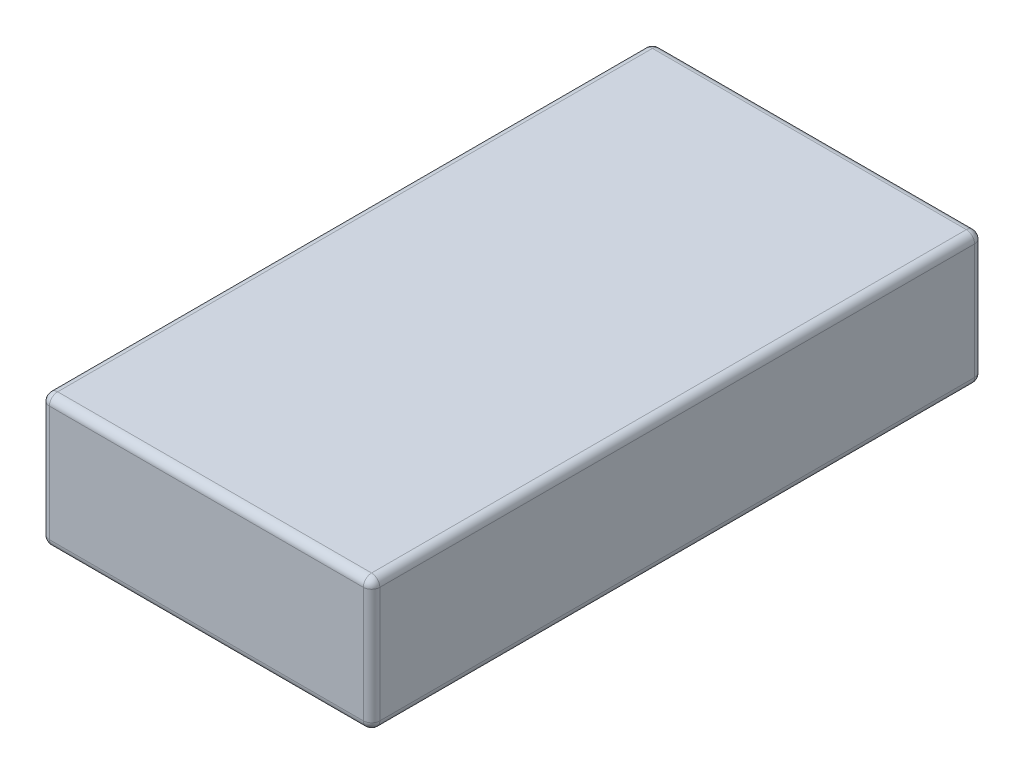
ISO-10303-21;
HEADER;
FILE_DESCRIPTION(('STEP AP214'),'2;1');
FILE_NAME('part.step','',(''),(''),'','','');
FILE_SCHEMA(('AUTOMOTIVE_DESIGN { 1 0 10303 214 1 1 1 1 }'));
ENDSEC;
DATA;
#1=APPLICATION_CONTEXT('core data for automotive mechanical design processes');
#2=APPLICATION_PROTOCOL_DEFINITION('international standard','automotive_design',2000,#1);
#3=PRODUCT_CONTEXT('',#1,'mechanical');
#4=PRODUCT('Part','Part','',(#3));
#5=PRODUCT_RELATED_PRODUCT_CATEGORY('part','',(#4));
#6=PRODUCT_DEFINITION_FORMATION('','',#4);
#7=PRODUCT_DEFINITION_CONTEXT('part definition',#1,'design');
#8=PRODUCT_DEFINITION('design','',#6,#7);
#9=PRODUCT_DEFINITION_SHAPE('','',#8);
#10=(LENGTH_UNIT() NAMED_UNIT(*) SI_UNIT(.MILLI.,.METRE.));
#11=(NAMED_UNIT(*) PLANE_ANGLE_UNIT() SI_UNIT($,.RADIAN.));
#12=(NAMED_UNIT(*) SI_UNIT($,.STERADIAN.) SOLID_ANGLE_UNIT());
#13=UNCERTAINTY_MEASURE_WITH_UNIT(LENGTH_MEASURE(1.E-05),#10,'distance_accuracy_value','');
#14=(GEOMETRIC_REPRESENTATION_CONTEXT(3) GLOBAL_UNCERTAINTY_ASSIGNED_CONTEXT((#13)) GLOBAL_UNIT_ASSIGNED_CONTEXT((#10,
#11,#12)) REPRESENTATION_CONTEXT('',''));
#15=CARTESIAN_POINT('',(0.,0.,0.));
#16=DIRECTION('',(0.,0.,1.));
#17=DIRECTION('',(1.,0.,0.));
#18=AXIS2_PLACEMENT_3D('',#15,#16,#17);
#19=CARTESIAN_POINT('',(10.,8.,18.5));
#20=DIRECTION('',(-1.,0.,0.));
#21=DIRECTION('',(0.,0.,1.));
#22=AXIS2_PLACEMENT_3D('',#19,#20,#21);
#23=PLANE('',#22);
#24=DIRECTION('',(0.,-1.,0.));
#25=VECTOR('',#24,1.);
#26=CARTESIAN_POINT('',(10.,8.,18.));
#27=LINE('',#26,#25);
#28=CARTESIAN_POINT('',(10.,7.5,18.));
#29=VERTEX_POINT('',#28);
#30=CARTESIAN_POINT('',(10.,0.5,18.));
#31=VERTEX_POINT('',#30);
#32=EDGE_CURVE('E208',#29,#31,#27,.T.);
#33=ORIENTED_EDGE('',*,*,#32,.T.);
#34=DIRECTION('',(0.,0.,-1.));
#35=VECTOR('',#34,1.);
#36=CARTESIAN_POINT('',(10.,0.5,-18.5));
#37=LINE('',#36,#35);
#38=CARTESIAN_POINT('',(10.,0.5,-18.));
#39=VERTEX_POINT('',#38);
#40=EDGE_CURVE('E212',#31,#39,#37,.T.);
#41=ORIENTED_EDGE('',*,*,#40,.T.);
#42=DIRECTION('',(0.,-1.,0.));
#43=VECTOR('',#42,1.);
#44=CARTESIAN_POINT('',(10.,8.,-18.));
#45=LINE('',#44,#43);
#46=CARTESIAN_POINT('',(10.,7.5,-18.));
#47=VERTEX_POINT('',#46);
#48=EDGE_CURVE('E205',#39,#47,#45,.F.);
#49=ORIENTED_EDGE('',*,*,#48,.T.);
#50=DIRECTION('',(0.,0.,-1.));
#51=VECTOR('',#50,1.);
#52=CARTESIAN_POINT('',(10.,7.5,18.5));
#53=LINE('',#52,#51);
#54=EDGE_CURVE('E202',#47,#29,#53,.F.);
#55=ORIENTED_EDGE('',*,*,#54,.T.);
#56=EDGE_LOOP('',(#33,#41,#49,#55));
#57=FACE_BOUND('',#56,.T.);
#58=ADVANCED_FACE('F39',(#57),#23,.F.);
#59=CARTESIAN_POINT('',(-10.,8.,-18.5));
#60=DIRECTION('',(0.,0.,1.));
#61=DIRECTION('',(1.,0.,0.));
#62=AXIS2_PLACEMENT_3D('',#59,#60,#61);
#63=PLANE('',#62);
#64=DIRECTION('',(0.,-1.,0.));
#65=VECTOR('',#64,1.);
#66=CARTESIAN_POINT('',(9.5,8.,-18.5));
#67=LINE('',#66,#65);
#68=CARTESIAN_POINT('',(9.5,7.5,-18.5));
#69=VERTEX_POINT('',#68);
#70=CARTESIAN_POINT('',(9.5,0.5,-18.5));
#71=VERTEX_POINT('',#70);
#72=EDGE_CURVE('E181',#69,#71,#67,.T.);
#73=ORIENTED_EDGE('',*,*,#72,.T.);
#74=DIRECTION('',(-1.,0.,0.));
#75=VECTOR('',#74,1.);
#76=CARTESIAN_POINT('',(-10.,0.5,-18.5));
#77=LINE('',#76,#75);
#78=CARTESIAN_POINT('',(-9.5,0.5,-18.5));
#79=VERTEX_POINT('',#78);
#80=EDGE_CURVE('E188',#71,#79,#77,.T.);
#81=ORIENTED_EDGE('',*,*,#80,.T.);
#82=DIRECTION('',(0.,-1.,0.));
#83=VECTOR('',#82,1.);
#84=CARTESIAN_POINT('',(-9.5,8.,-18.5));
#85=LINE('',#84,#83);
#86=CARTESIAN_POINT('',(-9.5,7.5,-18.5));
#87=VERTEX_POINT('',#86);
#88=EDGE_CURVE('E184',#79,#87,#85,.F.);
#89=ORIENTED_EDGE('',*,*,#88,.T.);
#90=DIRECTION('',(-1.,0.,0.));
#91=VECTOR('',#90,1.);
#92=CARTESIAN_POINT('',(-10.,7.5,-18.5));
#93=LINE('',#92,#91);
#94=EDGE_CURVE('E178',#87,#69,#93,.F.);
#95=ORIENTED_EDGE('',*,*,#94,.T.);
#96=EDGE_LOOP('',(#73,#81,#89,#95));
#97=FACE_BOUND('',#96,.T.);
#98=ADVANCED_FACE('F359',(#97),#63,.F.);
#99=CARTESIAN_POINT('',(-10.,8.,18.5));
#100=DIRECTION('',(1.,0.,0.));
#101=DIRECTION('',(0.,0.,-1.));
#102=AXIS2_PLACEMENT_3D('',#99,#100,#101);
#103=PLANE('',#102);
#104=DIRECTION('',(0.,-1.,0.));
#105=VECTOR('',#104,1.);
#106=CARTESIAN_POINT('',(-10.,8.,-18.));
#107=LINE('',#106,#105);
#108=CARTESIAN_POINT('',(-10.,7.5,-18.));
#109=VERTEX_POINT('',#108);
#110=CARTESIAN_POINT('',(-10.,0.5,-18.));
#111=VERTEX_POINT('',#110);
#112=EDGE_CURVE('E140',#109,#111,#107,.T.);
#113=ORIENTED_EDGE('',*,*,#112,.T.);
#114=DIRECTION('',(0.,0.,1.));
#115=VECTOR('',#114,1.);
#116=CARTESIAN_POINT('',(-10.,0.5,18.5));
#117=LINE('',#116,#115);
#118=CARTESIAN_POINT('',(-10.,0.5,18.));
#119=VERTEX_POINT('',#118);
#120=EDGE_CURVE('E135',#111,#119,#117,.T.);
#121=ORIENTED_EDGE('',*,*,#120,.T.);
#122=DIRECTION('',(0.,-1.,0.));
#123=VECTOR('',#122,1.);
#124=CARTESIAN_POINT('',(-10.,8.,18.));
#125=LINE('',#124,#123);
#126=CARTESIAN_POINT('',(-10.,7.5,18.));
#127=VERTEX_POINT('',#126);
#128=EDGE_CURVE('E127',#119,#127,#125,.F.);
#129=ORIENTED_EDGE('',*,*,#128,.T.);
#130=DIRECTION('',(0.,0.,1.));
#131=VECTOR('',#130,1.);
#132=CARTESIAN_POINT('',(-10.,7.5,18.5));
#133=LINE('',#132,#131);
#134=EDGE_CURVE('E132',#127,#109,#133,.F.);
#135=ORIENTED_EDGE('',*,*,#134,.T.);
#136=EDGE_LOOP('',(#113,#121,#129,#135));
#137=FACE_BOUND('',#136,.T.);
#138=ADVANCED_FACE('F130',(#137),#103,.F.);
#139=CARTESIAN_POINT('',(-10.,8.,18.5));
#140=DIRECTION('',(0.,0.,-1.));
#141=DIRECTION('',(-1.,0.,0.));
#142=AXIS2_PLACEMENT_3D('',#139,#140,#141);
#143=PLANE('',#142);
#144=DIRECTION('',(0.,-1.,0.));
#145=VECTOR('',#144,1.);
#146=CARTESIAN_POINT('',(-9.5,8.,18.5));
#147=LINE('',#146,#145);
#148=CARTESIAN_POINT('',(-9.5,7.5,18.5));
#149=VERTEX_POINT('',#148);
#150=CARTESIAN_POINT('',(-9.5,0.5,18.5));
#151=VERTEX_POINT('',#150);
#152=EDGE_CURVE('E148',#149,#151,#147,.T.);
#153=ORIENTED_EDGE('',*,*,#152,.T.);
#154=DIRECTION('',(1.,0.,0.));
#155=VECTOR('',#154,1.);
#156=CARTESIAN_POINT('',(10.,0.5,18.5));
#157=LINE('',#156,#155);
#158=CARTESIAN_POINT('',(9.5,0.5,18.5));
#159=VERTEX_POINT('',#158);
#160=EDGE_CURVE('E199',#151,#159,#157,.T.);
#161=ORIENTED_EDGE('',*,*,#160,.T.);
#162=DIRECTION('',(0.,-1.,0.));
#163=VECTOR('',#162,1.);
#164=CARTESIAN_POINT('',(9.5,8.,18.5));
#165=LINE('',#164,#163);
#166=CARTESIAN_POINT('',(9.5,7.5,18.5));
#167=VERTEX_POINT('',#166);
#168=EDGE_CURVE('E194',#159,#167,#165,.F.);
#169=ORIENTED_EDGE('',*,*,#168,.T.);
#170=DIRECTION('',(1.,0.,0.));
#171=VECTOR('',#170,1.);
#172=CARTESIAN_POINT('',(-10.,7.5,18.5));
#173=LINE('',#172,#171);
#174=EDGE_CURVE('E191',#167,#149,#173,.F.);
#175=ORIENTED_EDGE('',*,*,#174,.T.);
#176=EDGE_LOOP('',(#153,#161,#169,#175));
#177=FACE_BOUND('',#176,.T.);
#178=ADVANCED_FACE('F350',(#177),#143,.F.);
#179=CARTESIAN_POINT('',(0.,8.,0.));
#180=DIRECTION('',(0.,-1.,0.));
#181=DIRECTION('',(0.,0.,-1.));
#182=AXIS2_PLACEMENT_3D('',#179,#180,#181);
#183=PLANE('',#182);
#184=DIRECTION('',(0.,0.,1.));
#185=VECTOR('',#184,1.);
#186=CARTESIAN_POINT('',(-9.5,8.,0.));
#187=LINE('',#186,#185);
#188=CARTESIAN_POINT('',(-9.5,8.,-18.));
#189=VERTEX_POINT('',#188);
#190=CARTESIAN_POINT('',(-9.5,8.,18.));
#191=VERTEX_POINT('',#190);
#192=EDGE_CURVE('E49',#189,#191,#187,.T.);
#193=ORIENTED_EDGE('',*,*,#192,.T.);
#194=DIRECTION('',(1.,0.,0.));
#195=VECTOR('',#194,1.);
#196=CARTESIAN_POINT('',(0.,8.,18.));
#197=LINE('',#196,#195);
#198=CARTESIAN_POINT('',(9.5,8.,18.));
#199=VERTEX_POINT('',#198);
#200=EDGE_CURVE('E11',#191,#199,#197,.T.);
#201=ORIENTED_EDGE('',*,*,#200,.T.);
#202=DIRECTION('',(0.,0.,-1.));
#203=VECTOR('',#202,1.);
#204=CARTESIAN_POINT('',(9.5,8.,0.));
#205=LINE('',#204,#203);
#206=CARTESIAN_POINT('',(9.5,8.,-18.));
#207=VERTEX_POINT('',#206);
#208=EDGE_CURVE('E228',#199,#207,#205,.T.);
#209=ORIENTED_EDGE('',*,*,#208,.T.);
#210=DIRECTION('',(-1.,0.,0.));
#211=VECTOR('',#210,1.);
#212=CARTESIAN_POINT('',(0.,8.,-18.));
#213=LINE('',#212,#211);
#214=EDGE_CURVE('E60',#207,#189,#213,.T.);
#215=ORIENTED_EDGE('',*,*,#214,.T.);
#216=EDGE_LOOP('',(#193,#201,#209,#215));
#217=FACE_BOUND('',#216,.T.);
#218=ADVANCED_FACE('F352',(#217),#183,.F.);
#219=CARTESIAN_POINT('',(0.,0.,0.));
#220=DIRECTION('',(0.,-1.,0.));
#221=DIRECTION('',(0.,0.,-1.));
#222=AXIS2_PLACEMENT_3D('',#219,#220,#221);
#223=PLANE('',#222);
#224=DIRECTION('',(0.,0.,1.));
#225=VECTOR('',#224,1.);
#226=CARTESIAN_POINT('',(-9.5,0.,-18.5));
#227=LINE('',#226,#225);
#228=CARTESIAN_POINT('',(-9.5,0.,18.));
#229=VERTEX_POINT('',#228);
#230=CARTESIAN_POINT('',(-9.5,0.,-18.));
#231=VERTEX_POINT('',#230);
#232=EDGE_CURVE('E221',#229,#231,#227,.F.);
#233=ORIENTED_EDGE('',*,*,#232,.T.);
#234=DIRECTION('',(-1.,0.,0.));
#235=VECTOR('',#234,1.);
#236=CARTESIAN_POINT('',(10.,0.,-18.));
#237=LINE('',#236,#235);
#238=CARTESIAN_POINT('',(9.5,0.,-18.));
#239=VERTEX_POINT('',#238);
#240=EDGE_CURVE('E224',#231,#239,#237,.F.);
#241=ORIENTED_EDGE('',*,*,#240,.T.);
#242=DIRECTION('',(0.,0.,-1.));
#243=VECTOR('',#242,1.);
#244=CARTESIAN_POINT('',(9.5,0.,18.5));
#245=LINE('',#244,#243);
#246=CARTESIAN_POINT('',(9.5,0.,18.));
#247=VERTEX_POINT('',#246);
#248=EDGE_CURVE('E215',#239,#247,#245,.F.);
#249=ORIENTED_EDGE('',*,*,#248,.T.);
#250=DIRECTION('',(1.,0.,0.));
#251=VECTOR('',#250,1.);
#252=CARTESIAN_POINT('',(-10.,0.,18.));
#253=LINE('',#252,#251);
#254=EDGE_CURVE('E218',#247,#229,#253,.F.);
#255=ORIENTED_EDGE('',*,*,#254,.T.);
#256=EDGE_LOOP('',(#233,#241,#249,#255));
#257=FACE_BOUND('',#256,.T.);
#258=ADVANCED_FACE('F319',(#257),#223,.T.);
#259=CARTESIAN_POINT('',(9.5,8.,18.));
#260=DIRECTION('',(0.,-1.,0.));
#261=DIRECTION('',(0.,0.,-1.));
#262=AXIS2_PLACEMENT_3D('',#259,#260,#261);
#263=CYLINDRICAL_SURFACE('',#262,0.5);
#264=CARTESIAN_POINT('',(9.5,7.5,18.));
#265=DIRECTION('',(0.,1.,0.));
#266=DIRECTION('',(0.,0.,1.));
#267=AXIS2_PLACEMENT_3D('',#264,#265,#266);
#268=CIRCLE('',#267,0.5);
#269=EDGE_CURVE('E43',#167,#29,#268,.T.);
#270=ORIENTED_EDGE('',*,*,#269,.F.);
#271=ORIENTED_EDGE('',*,*,#168,.F.);
#272=CARTESIAN_POINT('',(9.5,0.5,18.));
#273=DIRECTION('',(0.,-1.,0.));
#274=DIRECTION('',(0.,0.,-1.));
#275=AXIS2_PLACEMENT_3D('',#272,#273,#274);
#276=CIRCLE('',#275,0.5);
#277=EDGE_CURVE('E172',#31,#159,#276,.T.);
#278=ORIENTED_EDGE('',*,*,#277,.F.);
#279=ORIENTED_EDGE('',*,*,#32,.F.);
#280=EDGE_LOOP('',(#270,#271,#278,#279));
#281=FACE_BOUND('',#280,.T.);
#282=ADVANCED_FACE('F41',(#281),#263,.T.);
#283=CARTESIAN_POINT('',(9.5,7.5,18.));
#284=DIRECTION('',(1.,0.,0.));
#285=DIRECTION('',(0.,0.,-1.));
#286=AXIS2_PLACEMENT_3D('',#283,#284,#285);
#287=SPHERICAL_SURFACE('',#286,0.5);
#288=CARTESIAN_POINT('',(9.5,7.5,18.));
#289=DIRECTION('',(1.,0.,0.));
#290=DIRECTION('',(0.,0.,-1.));
#291=AXIS2_PLACEMENT_3D('',#288,#289,#290);
#292=CIRCLE('',#291,0.5);
#293=EDGE_CURVE('E295',#167,#199,#292,.F.);
#294=ORIENTED_EDGE('',*,*,#293,.F.);
#295=ORIENTED_EDGE('',*,*,#269,.T.);
#296=CARTESIAN_POINT('',(9.5,7.5,18.));
#297=DIRECTION('',(0.,0.,1.));
#298=DIRECTION('',(1.,0.,0.));
#299=AXIS2_PLACEMENT_3D('',#296,#297,#298);
#300=CIRCLE('',#299,0.5);
#301=EDGE_CURVE('E299',#199,#29,#300,.F.);
#302=ORIENTED_EDGE('',*,*,#301,.F.);
#303=EDGE_LOOP('',(#294,#295,#302));
#304=FACE_BOUND('',#303,.T.);
#305=ADVANCED_FACE('F345',(#304),#287,.T.);
#306=CARTESIAN_POINT('',(9.5,0.5,18.));
#307=DIRECTION('',(0.,0.,1.));
#308=DIRECTION('',(0.,-1.,0.));
#309=AXIS2_PLACEMENT_3D('',#306,#307,#308);
#310=SPHERICAL_SURFACE('',#309,0.5);
#311=CARTESIAN_POINT('',(9.5,0.5,18.));
#312=DIRECTION('',(0.,0.,1.));
#313=DIRECTION('',(1.,0.,0.));
#314=AXIS2_PLACEMENT_3D('',#311,#312,#313);
#315=CIRCLE('',#314,0.5);
#316=EDGE_CURVE('E287',#31,#247,#315,.F.);
#317=ORIENTED_EDGE('',*,*,#316,.F.);
#318=ORIENTED_EDGE('',*,*,#277,.T.);
#319=CARTESIAN_POINT('',(9.5,0.5,18.));
#320=DIRECTION('',(1.,0.,0.));
#321=DIRECTION('',(0.,0.,-1.));
#322=AXIS2_PLACEMENT_3D('',#319,#320,#321);
#323=CIRCLE('',#322,0.5);
#324=EDGE_CURVE('E291',#247,#159,#323,.F.);
#325=ORIENTED_EDGE('',*,*,#324,.F.);
#326=EDGE_LOOP('',(#317,#318,#325));
#327=FACE_BOUND('',#326,.T.);
#328=ADVANCED_FACE('F308',(#327),#310,.T.);
#329=CARTESIAN_POINT('',(9.5,7.5,0.));
#330=DIRECTION('',(0.,0.,-1.));
#331=DIRECTION('',(-1.,0.,0.));
#332=AXIS2_PLACEMENT_3D('',#329,#330,#331);
#333=CYLINDRICAL_SURFACE('',#332,0.5);
#334=ORIENTED_EDGE('',*,*,#301,.T.);
#335=ORIENTED_EDGE('',*,*,#54,.F.);
#336=CARTESIAN_POINT('',(9.5,7.5,-18.));
#337=DIRECTION('',(0.,0.,-1.));
#338=DIRECTION('',(-1.,0.,0.));
#339=AXIS2_PLACEMENT_3D('',#336,#337,#338);
#340=CIRCLE('',#339,0.5);
#341=EDGE_CURVE('E279',#207,#47,#340,.T.);
#342=ORIENTED_EDGE('',*,*,#341,.F.);
#343=ORIENTED_EDGE('',*,*,#208,.F.);
#344=EDGE_LOOP('',(#334,#335,#342,#343));
#345=FACE_BOUND('',#344,.T.);
#346=ADVANCED_FACE('F340',(#345),#333,.T.);
#347=CARTESIAN_POINT('',(0.,7.5,18.));
#348=DIRECTION('',(1.,0.,0.));
#349=DIRECTION('',(0.,0.,-1.));
#350=AXIS2_PLACEMENT_3D('',#347,#348,#349);
#351=CYLINDRICAL_SURFACE('',#350,0.5);
#352=ORIENTED_EDGE('',*,*,#293,.T.);
#353=ORIENTED_EDGE('',*,*,#200,.F.);
#354=CARTESIAN_POINT('',(-9.5,7.5,18.));
#355=DIRECTION('',(-1.,0.,0.));
#356=DIRECTION('',(0.,0.,1.));
#357=AXIS2_PLACEMENT_3D('',#354,#355,#356);
#358=CIRCLE('',#357,0.5);
#359=EDGE_CURVE('E153',#149,#191,#358,.T.);
#360=ORIENTED_EDGE('',*,*,#359,.F.);
#361=ORIENTED_EDGE('',*,*,#174,.F.);
#362=EDGE_LOOP('',(#352,#353,#360,#361));
#363=FACE_BOUND('',#362,.T.);
#364=ADVANCED_FACE('F348',(#363),#351,.T.);
#365=CARTESIAN_POINT('',(-9.5,8.,18.));
#366=DIRECTION('',(0.,-1.,0.));
#367=DIRECTION('',(0.,0.,-1.));
#368=AXIS2_PLACEMENT_3D('',#365,#366,#367);
#369=CYLINDRICAL_SURFACE('',#368,0.5);
#370=CARTESIAN_POINT('',(-9.5,0.5,18.));
#371=DIRECTION('',(0.,-1.,0.));
#372=DIRECTION('',(0.,0.,-1.));
#373=AXIS2_PLACEMENT_3D('',#370,#371,#372);
#374=CIRCLE('',#373,0.5);
#375=EDGE_CURVE('E154',#151,#119,#374,.T.);
#376=ORIENTED_EDGE('',*,*,#375,.F.);
#377=ORIENTED_EDGE('',*,*,#152,.F.);
#378=CARTESIAN_POINT('',(-9.5,7.5,18.));
#379=DIRECTION('',(0.,1.,0.));
#380=DIRECTION('',(0.,0.,1.));
#381=AXIS2_PLACEMENT_3D('',#378,#379,#380);
#382=CIRCLE('',#381,0.5);
#383=EDGE_CURVE('E144',#127,#149,#382,.T.);
#384=ORIENTED_EDGE('',*,*,#383,.F.);
#385=ORIENTED_EDGE('',*,*,#128,.F.);
#386=EDGE_LOOP('',(#376,#377,#384,#385));
#387=FACE_BOUND('',#386,.T.);
#388=ADVANCED_FACE('F146',(#387),#369,.T.);
#389=CARTESIAN_POINT('',(-10.,0.5,18.));
#390=DIRECTION('',(-1.,0.,0.));
#391=DIRECTION('',(0.,0.,1.));
#392=AXIS2_PLACEMENT_3D('',#389,#390,#391);
#393=CYLINDRICAL_SURFACE('',#392,0.5);
#394=ORIENTED_EDGE('',*,*,#324,.T.);
#395=ORIENTED_EDGE('',*,*,#160,.F.);
#396=CARTESIAN_POINT('',(-9.5,0.5,18.));
#397=DIRECTION('',(-1.,0.,0.));
#398=DIRECTION('',(0.,0.,1.));
#399=AXIS2_PLACEMENT_3D('',#396,#397,#398);
#400=CIRCLE('',#399,0.5);
#401=EDGE_CURVE('E272',#229,#151,#400,.T.);
#402=ORIENTED_EDGE('',*,*,#401,.F.);
#403=ORIENTED_EDGE('',*,*,#254,.F.);
#404=EDGE_LOOP('',(#394,#395,#402,#403));
#405=FACE_BOUND('',#404,.T.);
#406=ADVANCED_FACE('F315',(#405),#393,.T.);
#407=CARTESIAN_POINT('',(9.5,0.5,18.5));
#408=DIRECTION('',(0.,0.,1.));
#409=DIRECTION('',(1.,0.,0.));
#410=AXIS2_PLACEMENT_3D('',#407,#408,#409);
#411=CYLINDRICAL_SURFACE('',#410,0.5);
#412=ORIENTED_EDGE('',*,*,#316,.T.);
#413=ORIENTED_EDGE('',*,*,#248,.F.);
#414=CARTESIAN_POINT('',(9.5,0.5,-18.));
#415=DIRECTION('',(0.,0.,-1.));
#416=DIRECTION('',(-1.,0.,0.));
#417=AXIS2_PLACEMENT_3D('',#414,#415,#416);
#418=CIRCLE('',#417,0.5);
#419=EDGE_CURVE('E268',#39,#239,#418,.T.);
#420=ORIENTED_EDGE('',*,*,#419,.F.);
#421=ORIENTED_EDGE('',*,*,#40,.F.);
#422=EDGE_LOOP('',(#412,#413,#420,#421));
#423=FACE_BOUND('',#422,.T.);
#424=ADVANCED_FACE('F325',(#423),#411,.T.);
#425=CARTESIAN_POINT('',(9.5,8.,-18.));
#426=DIRECTION('',(0.,-1.,0.));
#427=DIRECTION('',(0.,0.,-1.));
#428=AXIS2_PLACEMENT_3D('',#425,#426,#427);
#429=CYLINDRICAL_SURFACE('',#428,0.5);
#430=CARTESIAN_POINT('',(9.5,7.5,-18.));
#431=DIRECTION('',(0.,1.,0.));
#432=DIRECTION('',(0.,0.,1.));
#433=AXIS2_PLACEMENT_3D('',#430,#431,#432);
#434=CIRCLE('',#433,0.5);
#435=EDGE_CURVE('E283',#47,#69,#434,.T.);
#436=ORIENTED_EDGE('',*,*,#435,.F.);
#437=ORIENTED_EDGE('',*,*,#48,.F.);
#438=CARTESIAN_POINT('',(9.5,0.5,-18.));
#439=DIRECTION('',(0.,-1.,0.));
#440=DIRECTION('',(0.,0.,-1.));
#441=AXIS2_PLACEMENT_3D('',#438,#439,#440);
#442=CIRCLE('',#441,0.5);
#443=EDGE_CURVE('E264',#71,#39,#442,.T.);
#444=ORIENTED_EDGE('',*,*,#443,.F.);
#445=ORIENTED_EDGE('',*,*,#72,.F.);
#446=EDGE_LOOP('',(#436,#437,#444,#445));
#447=FACE_BOUND('',#446,.T.);
#448=ADVANCED_FACE('F332',(#447),#429,.T.);
#449=CARTESIAN_POINT('',(9.5,7.5,-18.));
#450=DIRECTION('',(1.,0.,0.));
#451=DIRECTION('',(0.,0.,-1.));
#452=AXIS2_PLACEMENT_3D('',#449,#450,#451);
#453=SPHERICAL_SURFACE('',#452,0.5);
#454=ORIENTED_EDGE('',*,*,#341,.T.);
#455=ORIENTED_EDGE('',*,*,#435,.T.);
#456=CARTESIAN_POINT('',(9.5,7.5,-18.));
#457=DIRECTION('',(1.,0.,0.));
#458=DIRECTION('',(0.,0.,-1.));
#459=AXIS2_PLACEMENT_3D('',#456,#457,#458);
#460=CIRCLE('',#459,0.5);
#461=EDGE_CURVE('E161',#207,#69,#460,.F.);
#462=ORIENTED_EDGE('',*,*,#461,.F.);
#463=EDGE_LOOP('',(#454,#455,#462));
#464=FACE_BOUND('',#463,.T.);
#465=ADVANCED_FACE('F338',(#464),#453,.T.);
#466=CARTESIAN_POINT('',(-9.5,7.5,18.));
#467=DIRECTION('',(0.,0.,1.));
#468=DIRECTION('',(1.,0.,0.));
#469=AXIS2_PLACEMENT_3D('',#466,#467,#468);
#470=SPHERICAL_SURFACE('',#469,0.5);
#471=ORIENTED_EDGE('',*,*,#383,.T.);
#472=ORIENTED_EDGE('',*,*,#359,.T.);
#473=CARTESIAN_POINT('',(-9.5,7.5,18.));
#474=DIRECTION('',(0.,0.,1.));
#475=DIRECTION('',(1.,0.,0.));
#476=AXIS2_PLACEMENT_3D('',#473,#474,#475);
#477=CIRCLE('',#476,0.5);
#478=EDGE_CURVE('E157',#127,#191,#477,.F.);
#479=ORIENTED_EDGE('',*,*,#478,.F.);
#480=EDGE_LOOP('',(#471,#472,#479));
#481=FACE_BOUND('',#480,.T.);
#482=ADVANCED_FACE('F158',(#481),#470,.T.);
#483=CARTESIAN_POINT('',(-9.5,0.5,18.));
#484=DIRECTION('',(0.,0.,1.));
#485=DIRECTION('',(0.,-1.,0.));
#486=AXIS2_PLACEMENT_3D('',#483,#484,#485);
#487=SPHERICAL_SURFACE('',#486,0.5);
#488=ORIENTED_EDGE('',*,*,#401,.T.);
#489=ORIENTED_EDGE('',*,*,#375,.T.);
#490=CARTESIAN_POINT('',(-9.5,0.5,18.));
#491=DIRECTION('',(0.,0.,1.));
#492=DIRECTION('',(1.,0.,0.));
#493=AXIS2_PLACEMENT_3D('',#490,#491,#492);
#494=CIRCLE('',#493,0.5);
#495=EDGE_CURVE('E162',#229,#119,#494,.F.);
#496=ORIENTED_EDGE('',*,*,#495,.F.);
#497=EDGE_LOOP('',(#488,#489,#496));
#498=FACE_BOUND('',#497,.T.);
#499=ADVANCED_FACE('F399',(#498),#487,.T.);
#500=CARTESIAN_POINT('',(9.5,0.5,-18.));
#501=DIRECTION('',(1.,0.,0.));
#502=DIRECTION('',(0.,1.,0.));
#503=AXIS2_PLACEMENT_3D('',#500,#501,#502);
#504=SPHERICAL_SURFACE('',#503,0.5);
#505=ORIENTED_EDGE('',*,*,#443,.T.);
#506=ORIENTED_EDGE('',*,*,#419,.T.);
#507=CARTESIAN_POINT('',(9.5,0.5,-18.));
#508=DIRECTION('',(1.,0.,0.));
#509=DIRECTION('',(0.,0.,-1.));
#510=AXIS2_PLACEMENT_3D('',#507,#508,#509);
#511=CIRCLE('',#510,0.5);
#512=EDGE_CURVE('E255',#71,#239,#511,.F.);
#513=ORIENTED_EDGE('',*,*,#512,.F.);
#514=EDGE_LOOP('',(#505,#506,#513));
#515=FACE_BOUND('',#514,.T.);
#516=ADVANCED_FACE('F395',(#515),#504,.T.);
#517=CARTESIAN_POINT('',(0.,7.5,-18.));
#518=DIRECTION('',(-1.,0.,0.));
#519=DIRECTION('',(0.,0.,1.));
#520=AXIS2_PLACEMENT_3D('',#517,#518,#519);
#521=CYLINDRICAL_SURFACE('',#520,0.5);
#522=ORIENTED_EDGE('',*,*,#461,.T.);
#523=ORIENTED_EDGE('',*,*,#94,.F.);
#524=CARTESIAN_POINT('',(-9.5,7.5,-18.));
#525=DIRECTION('',(-1.,0.,0.));
#526=DIRECTION('',(0.,0.,1.));
#527=AXIS2_PLACEMENT_3D('',#524,#525,#526);
#528=CIRCLE('',#527,0.5);
#529=EDGE_CURVE('E251',#189,#87,#528,.T.);
#530=ORIENTED_EDGE('',*,*,#529,.F.);
#531=ORIENTED_EDGE('',*,*,#214,.F.);
#532=EDGE_LOOP('',(#522,#523,#530,#531));
#533=FACE_BOUND('',#532,.T.);
#534=ADVANCED_FACE('F392',(#533),#521,.T.);
#535=CARTESIAN_POINT('',(-9.5,7.5,0.));
#536=DIRECTION('',(0.,0.,1.));
#537=DIRECTION('',(1.,0.,0.));
#538=AXIS2_PLACEMENT_3D('',#535,#536,#537);
#539=CYLINDRICAL_SURFACE('',#538,0.5);
#540=ORIENTED_EDGE('',*,*,#478,.T.);
#541=ORIENTED_EDGE('',*,*,#192,.F.);
#542=CARTESIAN_POINT('',(-9.5,7.5,-18.));
#543=DIRECTION('',(0.,0.,-1.));
#544=DIRECTION('',(-1.,0.,0.));
#545=AXIS2_PLACEMENT_3D('',#542,#543,#544);
#546=CIRCLE('',#545,0.5);
#547=EDGE_CURVE('E166',#109,#189,#546,.T.);
#548=ORIENTED_EDGE('',*,*,#547,.F.);
#549=ORIENTED_EDGE('',*,*,#134,.F.);
#550=EDGE_LOOP('',(#540,#541,#548,#549));
#551=FACE_BOUND('',#550,.T.);
#552=ADVANCED_FACE('F164',(#551),#539,.T.);
#553=CARTESIAN_POINT('',(-9.5,0.5,18.5));
#554=DIRECTION('',(0.,0.,-1.));
#555=DIRECTION('',(-1.,0.,0.));
#556=AXIS2_PLACEMENT_3D('',#553,#554,#555);
#557=CYLINDRICAL_SURFACE('',#556,0.5);
#558=ORIENTED_EDGE('',*,*,#495,.T.);
#559=ORIENTED_EDGE('',*,*,#120,.F.);
#560=CARTESIAN_POINT('',(-9.5,0.5,-18.));
#561=DIRECTION('',(0.,0.,-1.));
#562=DIRECTION('',(-1.,0.,0.));
#563=AXIS2_PLACEMENT_3D('',#560,#561,#562);
#564=CIRCLE('',#563,0.5);
#565=EDGE_CURVE('E245',#231,#111,#564,.T.);
#566=ORIENTED_EDGE('',*,*,#565,.F.);
#567=ORIENTED_EDGE('',*,*,#232,.F.);
#568=EDGE_LOOP('',(#558,#559,#566,#567));
#569=FACE_BOUND('',#568,.T.);
#570=ADVANCED_FACE('F385',(#569),#557,.T.);
#571=CARTESIAN_POINT('',(-10.,0.5,-18.));
#572=DIRECTION('',(1.,0.,0.));
#573=DIRECTION('',(0.,0.,-1.));
#574=AXIS2_PLACEMENT_3D('',#571,#572,#573);
#575=CYLINDRICAL_SURFACE('',#574,0.5);
#576=ORIENTED_EDGE('',*,*,#512,.T.);
#577=ORIENTED_EDGE('',*,*,#240,.F.);
#578=CARTESIAN_POINT('',(-9.5,0.5,-18.));
#579=DIRECTION('',(-1.,0.,0.));
#580=DIRECTION('',(0.,0.,1.));
#581=AXIS2_PLACEMENT_3D('',#578,#579,#580);
#582=CIRCLE('',#581,0.5);
#583=EDGE_CURVE('E241',#79,#231,#582,.T.);
#584=ORIENTED_EDGE('',*,*,#583,.F.);
#585=ORIENTED_EDGE('',*,*,#80,.F.);
#586=EDGE_LOOP('',(#576,#577,#584,#585));
#587=FACE_BOUND('',#586,.T.);
#588=ADVANCED_FACE('F381',(#587),#575,.T.);
#589=CARTESIAN_POINT('',(-9.5,7.5,-18.));
#590=DIRECTION('',(0.,1.,0.));
#591=DIRECTION('',(0.,0.,1.));
#592=AXIS2_PLACEMENT_3D('',#589,#590,#591);
#593=SPHERICAL_SURFACE('',#592,0.5);
#594=ORIENTED_EDGE('',*,*,#547,.T.);
#595=ORIENTED_EDGE('',*,*,#529,.T.);
#596=CARTESIAN_POINT('',(-9.5,7.5,-18.));
#597=DIRECTION('',(0.,1.,0.));
#598=DIRECTION('',(0.,0.,1.));
#599=AXIS2_PLACEMENT_3D('',#596,#597,#598);
#600=CIRCLE('',#599,0.5);
#601=EDGE_CURVE('E238',#109,#87,#600,.F.);
#602=ORIENTED_EDGE('',*,*,#601,.F.);
#603=EDGE_LOOP('',(#594,#595,#602));
#604=FACE_BOUND('',#603,.T.);
#605=ADVANCED_FACE('F377',(#604),#593,.T.);
#606=CARTESIAN_POINT('',(-9.5,0.5,-18.));
#607=DIRECTION('',(0.,-1.,0.));
#608=DIRECTION('',(0.,0.,-1.));
#609=AXIS2_PLACEMENT_3D('',#606,#607,#608);
#610=SPHERICAL_SURFACE('',#609,0.5);
#611=ORIENTED_EDGE('',*,*,#583,.T.);
#612=ORIENTED_EDGE('',*,*,#565,.T.);
#613=CARTESIAN_POINT('',(-9.5,0.5,-18.));
#614=DIRECTION('',(0.,-1.,0.));
#615=DIRECTION('',(0.,0.,-1.));
#616=AXIS2_PLACEMENT_3D('',#613,#614,#615);
#617=CIRCLE('',#616,0.5);
#618=EDGE_CURVE('E235',#79,#111,#617,.F.);
#619=ORIENTED_EDGE('',*,*,#618,.F.);
#620=EDGE_LOOP('',(#611,#612,#619));
#621=FACE_BOUND('',#620,.T.);
#622=ADVANCED_FACE('F373',(#621),#610,.T.);
#623=CARTESIAN_POINT('',(-9.5,8.,-18.));
#624=DIRECTION('',(0.,-1.,0.));
#625=DIRECTION('',(0.,0.,-1.));
#626=AXIS2_PLACEMENT_3D('',#623,#624,#625);
#627=CYLINDRICAL_SURFACE('',#626,0.5);
#628=ORIENTED_EDGE('',*,*,#601,.T.);
#629=ORIENTED_EDGE('',*,*,#88,.F.);
#630=ORIENTED_EDGE('',*,*,#618,.T.);
#631=ORIENTED_EDGE('',*,*,#112,.F.);
#632=EDGE_LOOP('',(#628,#629,#630,#631));
#633=FACE_BOUND('',#632,.T.);
#634=ADVANCED_FACE('F370',(#633),#627,.T.);
#635=CLOSED_SHELL('',(#58,#98,#138,#178,#218,#258,#282,#305,#328,#346,#364,#388,#406,#424,#448,
#465,#482,#499,#516,#534,#552,#570,#588,#605,#622,#634));
#636=MANIFOLD_SOLID_BREP('B2',#635);
#637=ADVANCED_BREP_SHAPE_REPRESENTATION('',(#18,#636),#14);
#638=SHAPE_DEFINITION_REPRESENTATION(#9,#637);
ENDSEC;
END-ISO-10303-21;
